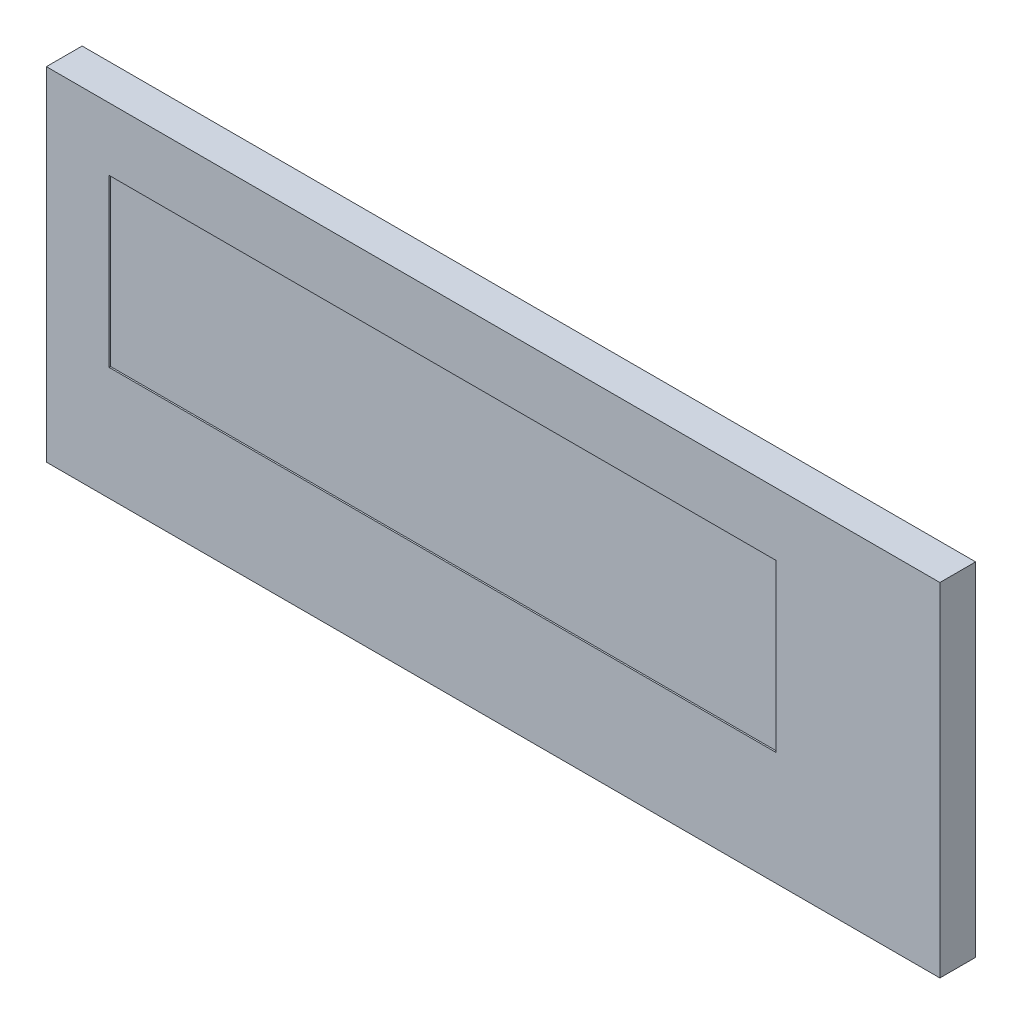
ISO-10303-21;
HEADER;
FILE_DESCRIPTION(('STEP AP214'),'2;1');
FILE_NAME('part.step','',(''),(''),'','','');
FILE_SCHEMA(('AUTOMOTIVE_DESIGN { 1 0 10303 214 1 1 1 1 }'));
ENDSEC;
DATA;
#1=APPLICATION_CONTEXT('core data for automotive mechanical design processes');
#2=APPLICATION_PROTOCOL_DEFINITION('international standard','automotive_design',2000,#1);
#3=PRODUCT_CONTEXT('',#1,'mechanical');
#4=PRODUCT('Part','Part','',(#3));
#5=PRODUCT_RELATED_PRODUCT_CATEGORY('part','',(#4));
#6=PRODUCT_DEFINITION_FORMATION('','',#4);
#7=PRODUCT_DEFINITION_CONTEXT('part definition',#1,'design');
#8=PRODUCT_DEFINITION('design','',#6,#7);
#9=PRODUCT_DEFINITION_SHAPE('','',#8);
#10=(LENGTH_UNIT() NAMED_UNIT(*) SI_UNIT(.MILLI.,.METRE.));
#11=(NAMED_UNIT(*) PLANE_ANGLE_UNIT() SI_UNIT($,.RADIAN.));
#12=(NAMED_UNIT(*) SI_UNIT($,.STERADIAN.) SOLID_ANGLE_UNIT());
#13=UNCERTAINTY_MEASURE_WITH_UNIT(LENGTH_MEASURE(1.E-05),#10,'distance_accuracy_value','');
#14=(GEOMETRIC_REPRESENTATION_CONTEXT(3) GLOBAL_UNCERTAINTY_ASSIGNED_CONTEXT((#13)) GLOBAL_UNIT_ASSIGNED_CONTEXT((#10,
#11,#12)) REPRESENTATION_CONTEXT('',''));
#15=CARTESIAN_POINT('',(0.,0.,0.));
#16=DIRECTION('',(0.,0.,1.));
#17=DIRECTION('',(1.,0.,0.));
#18=AXIS2_PLACEMENT_3D('',#15,#16,#17);
#19=CARTESIAN_POINT('',(0.,2.792,1.2));
#20=DIRECTION('',(0.,1.,0.));
#21=DIRECTION('',(0.,0.,1.));
#22=AXIS2_PLACEMENT_3D('',#19,#20,#21);
#23=PLANE('',#22);
#24=DIRECTION('',(0.,0.,-1.));
#25=VECTOR('',#24,1.);
#26=CARTESIAN_POINT('',(-11.192,2.792,1.2));
#27=LINE('',#26,#25);
#28=CARTESIAN_POINT('',(-11.192,2.792,1.2));
#29=VERTEX_POINT('',#28);
#30=CARTESIAN_POINT('',(-11.192,2.792,1.15));
#31=VERTEX_POINT('',#30);
#32=EDGE_CURVE('E119',#29,#31,#27,.T.);
#33=ORIENTED_EDGE('',*,*,#32,.T.);
#34=DIRECTION('',(1.,0.,0.));
#35=VECTOR('',#34,1.);
#36=CARTESIAN_POINT('',(0.,2.792,1.15));
#37=LINE('',#36,#35);
#38=CARTESIAN_POINT('',(11.192,2.792,1.15));
#39=VERTEX_POINT('',#38);
#40=EDGE_CURVE('E57',#31,#39,#37,.T.);
#41=ORIENTED_EDGE('',*,*,#40,.T.);
#42=DIRECTION('',(0.,0.,-1.));
#43=VECTOR('',#42,1.);
#44=CARTESIAN_POINT('',(11.192,2.792,1.2));
#45=LINE('',#44,#43);
#46=CARTESIAN_POINT('',(11.192,2.792,1.2));
#47=VERTEX_POINT('',#46);
#48=EDGE_CURVE('E11',#47,#39,#45,.T.);
#49=ORIENTED_EDGE('',*,*,#48,.F.);
#50=DIRECTION('',(1.,0.,0.));
#51=VECTOR('',#50,1.);
#52=CARTESIAN_POINT('',(0.,2.792,1.2));
#53=LINE('',#52,#51);
#54=EDGE_CURVE('E150',#29,#47,#53,.T.);
#55=ORIENTED_EDGE('',*,*,#54,.F.);
#56=EDGE_LOOP('',(#33,#41,#49,#55));
#57=FACE_BOUND('',#56,.T.);
#58=ADVANCED_FACE('F39',(#57),#23,.F.);
#59=CARTESIAN_POINT('',(11.192,0.,1.2));
#60=DIRECTION('',(1.,0.,0.));
#61=DIRECTION('',(0.,0.,-1.));
#62=AXIS2_PLACEMENT_3D('',#59,#60,#61);
#63=PLANE('',#62);
#64=ORIENTED_EDGE('',*,*,#48,.T.);
#65=DIRECTION('',(0.,-1.,0.));
#66=VECTOR('',#65,1.);
#67=CARTESIAN_POINT('',(11.192,0.,1.15));
#68=LINE('',#67,#66);
#69=CARTESIAN_POINT('',(11.192,-2.792,1.15));
#70=VERTEX_POINT('',#69);
#71=EDGE_CURVE('E63',#39,#70,#68,.T.);
#72=ORIENTED_EDGE('',*,*,#71,.T.);
#73=DIRECTION('',(0.,0.,-1.));
#74=VECTOR('',#73,1.);
#75=CARTESIAN_POINT('',(11.192,-2.792,1.2));
#76=LINE('',#75,#74);
#77=CARTESIAN_POINT('',(11.192,-2.792,1.2));
#78=VERTEX_POINT('',#77);
#79=EDGE_CURVE('E49',#78,#70,#76,.T.);
#80=ORIENTED_EDGE('',*,*,#79,.F.);
#81=DIRECTION('',(0.,-1.,0.));
#82=VECTOR('',#81,1.);
#83=CARTESIAN_POINT('',(11.192,0.,1.2));
#84=LINE('',#83,#82);
#85=EDGE_CURVE('E154',#47,#78,#84,.T.);
#86=ORIENTED_EDGE('',*,*,#85,.F.);
#87=EDGE_LOOP('',(#64,#72,#80,#86));
#88=FACE_BOUND('',#87,.T.);
#89=ADVANCED_FACE('F213',(#88),#63,.F.);
#90=CARTESIAN_POINT('',(0.,-2.792,1.2));
#91=DIRECTION('',(0.,1.,0.));
#92=DIRECTION('',(0.,0.,1.));
#93=AXIS2_PLACEMENT_3D('',#90,#91,#92);
#94=PLANE('',#93);
#95=DIRECTION('',(1.,0.,0.));
#96=VECTOR('',#95,1.);
#97=CARTESIAN_POINT('',(0.,-2.792,1.15));
#98=LINE('',#97,#96);
#99=CARTESIAN_POINT('',(-11.192,-2.792,1.15));
#100=VERTEX_POINT('',#99);
#101=EDGE_CURVE('E122',#100,#70,#98,.T.);
#102=ORIENTED_EDGE('',*,*,#101,.F.);
#103=DIRECTION('',(0.,0.,-1.));
#104=VECTOR('',#103,1.);
#105=CARTESIAN_POINT('',(-11.192,-2.792,1.2));
#106=LINE('',#105,#104);
#107=CARTESIAN_POINT('',(-11.192,-2.792,1.2));
#108=VERTEX_POINT('',#107);
#109=EDGE_CURVE('E108',#108,#100,#106,.T.);
#110=ORIENTED_EDGE('',*,*,#109,.F.);
#111=DIRECTION('',(1.,0.,0.));
#112=VECTOR('',#111,1.);
#113=CARTESIAN_POINT('',(0.,-2.792,1.2));
#114=LINE('',#113,#112);
#115=EDGE_CURVE('E157',#108,#78,#114,.T.);
#116=ORIENTED_EDGE('',*,*,#115,.T.);
#117=ORIENTED_EDGE('',*,*,#79,.T.);
#118=EDGE_LOOP('',(#102,#110,#116,#117));
#119=FACE_BOUND('',#118,.T.);
#120=ADVANCED_FACE('F123',(#119),#94,.T.);
#121=CARTESIAN_POINT('',(16.7,0.,1.2));
#122=DIRECTION('',(1.,0.,0.));
#123=DIRECTION('',(0.,0.,-1.));
#124=AXIS2_PLACEMENT_3D('',#121,#122,#123);
#125=PLANE('',#124);
#126=DIRECTION('',(0.,-1.,0.));
#127=VECTOR('',#126,1.);
#128=CARTESIAN_POINT('',(16.7,0.,0.));
#129=LINE('',#128,#127);
#130=CARTESIAN_POINT('',(16.7,4.9,0.));
#131=VERTEX_POINT('',#130);
#132=CARTESIAN_POINT('',(16.7,-6.6,0.));
#133=VERTEX_POINT('',#132);
#134=EDGE_CURVE('E126',#131,#133,#129,.T.);
#135=ORIENTED_EDGE('',*,*,#134,.F.);
#136=DIRECTION('',(0.,0.,-1.));
#137=VECTOR('',#136,1.);
#138=CARTESIAN_POINT('',(16.7,4.9,1.2));
#139=LINE('',#138,#137);
#140=CARTESIAN_POINT('',(16.7,4.9,1.2));
#141=VERTEX_POINT('',#140);
#142=EDGE_CURVE('E43',#141,#131,#139,.T.);
#143=ORIENTED_EDGE('',*,*,#142,.F.);
#144=DIRECTION('',(0.,-1.,0.));
#145=VECTOR('',#144,1.);
#146=CARTESIAN_POINT('',(16.7,0.,1.2));
#147=LINE('',#146,#145);
#148=CARTESIAN_POINT('',(16.7,-6.6,1.2));
#149=VERTEX_POINT('',#148);
#150=EDGE_CURVE('E135',#141,#149,#147,.T.);
#151=ORIENTED_EDGE('',*,*,#150,.T.);
#152=DIRECTION('',(0.,0.,-1.));
#153=VECTOR('',#152,1.);
#154=CARTESIAN_POINT('',(16.7,-6.6,1.2));
#155=LINE('',#154,#153);
#156=EDGE_CURVE('E162',#149,#133,#155,.T.);
#157=ORIENTED_EDGE('',*,*,#156,.T.);
#158=EDGE_LOOP('',(#135,#143,#151,#157));
#159=FACE_BOUND('',#158,.T.);
#160=ADVANCED_FACE('F41',(#159),#125,.T.);
#161=CARTESIAN_POINT('',(0.,4.9,1.2));
#162=DIRECTION('',(0.,1.,0.));
#163=DIRECTION('',(0.,0.,1.));
#164=AXIS2_PLACEMENT_3D('',#161,#162,#163);
#165=PLANE('',#164);
#166=DIRECTION('',(1.,0.,0.));
#167=VECTOR('',#166,1.);
#168=CARTESIAN_POINT('',(0.,4.9,0.));
#169=LINE('',#168,#167);
#170=CARTESIAN_POINT('',(-13.3,4.9,0.));
#171=VERTEX_POINT('',#170);
#172=EDGE_CURVE('E166',#171,#131,#169,.T.);
#173=ORIENTED_EDGE('',*,*,#172,.F.);
#174=DIRECTION('',(0.,0.,-1.));
#175=VECTOR('',#174,1.);
#176=CARTESIAN_POINT('',(-13.3,4.9,1.2));
#177=LINE('',#176,#175);
#178=CARTESIAN_POINT('',(-13.3,4.9,1.2));
#179=VERTEX_POINT('',#178);
#180=EDGE_CURVE('E185',#179,#171,#177,.T.);
#181=ORIENTED_EDGE('',*,*,#180,.F.);
#182=DIRECTION('',(1.,0.,0.));
#183=VECTOR('',#182,1.);
#184=CARTESIAN_POINT('',(0.,4.9,1.2));
#185=LINE('',#184,#183);
#186=EDGE_CURVE('E139',#179,#141,#185,.T.);
#187=ORIENTED_EDGE('',*,*,#186,.T.);
#188=ORIENTED_EDGE('',*,*,#142,.T.);
#189=EDGE_LOOP('',(#173,#181,#187,#188));
#190=FACE_BOUND('',#189,.T.);
#191=ADVANCED_FACE('F194',(#190),#165,.T.);
#192=CARTESIAN_POINT('',(-13.3,0.,1.2));
#193=DIRECTION('',(1.,0.,0.));
#194=DIRECTION('',(0.,1.,0.));
#195=AXIS2_PLACEMENT_3D('',#192,#193,#194);
#196=PLANE('',#195);
#197=DIRECTION('',(0.,-1.,0.));
#198=VECTOR('',#197,1.);
#199=CARTESIAN_POINT('',(-13.3,0.,0.));
#200=LINE('',#199,#198);
#201=CARTESIAN_POINT('',(-13.3,-6.6,0.));
#202=VERTEX_POINT('',#201);
#203=EDGE_CURVE('E170',#171,#202,#200,.T.);
#204=ORIENTED_EDGE('',*,*,#203,.T.);
#205=DIRECTION('',(0.,0.,-1.));
#206=VECTOR('',#205,1.);
#207=CARTESIAN_POINT('',(-13.3,-6.6,1.2));
#208=LINE('',#207,#206);
#209=CARTESIAN_POINT('',(-13.3,-6.6,1.2));
#210=VERTEX_POINT('',#209);
#211=EDGE_CURVE('E182',#210,#202,#208,.T.);
#212=ORIENTED_EDGE('',*,*,#211,.F.);
#213=DIRECTION('',(0.,-1.,0.));
#214=VECTOR('',#213,1.);
#215=CARTESIAN_POINT('',(-13.3,0.,1.2));
#216=LINE('',#215,#214);
#217=EDGE_CURVE('E144',#179,#210,#216,.T.);
#218=ORIENTED_EDGE('',*,*,#217,.F.);
#219=ORIENTED_EDGE('',*,*,#180,.T.);
#220=EDGE_LOOP('',(#204,#212,#218,#219));
#221=FACE_BOUND('',#220,.T.);
#222=ADVANCED_FACE('F203',(#221),#196,.F.);
#223=CARTESIAN_POINT('',(0.,-6.6,1.2));
#224=DIRECTION('',(0.,1.,0.));
#225=DIRECTION('',(0.,0.,1.));
#226=AXIS2_PLACEMENT_3D('',#223,#224,#225);
#227=PLANE('',#226);
#228=DIRECTION('',(1.,0.,0.));
#229=VECTOR('',#228,1.);
#230=CARTESIAN_POINT('',(0.,-6.6,0.));
#231=LINE('',#230,#229);
#232=EDGE_CURVE('E140',#202,#133,#231,.T.);
#233=ORIENTED_EDGE('',*,*,#232,.T.);
#234=ORIENTED_EDGE('',*,*,#156,.F.);
#235=DIRECTION('',(1.,0.,0.));
#236=VECTOR('',#235,1.);
#237=CARTESIAN_POINT('',(0.,-6.6,1.2));
#238=LINE('',#237,#236);
#239=EDGE_CURVE('E147',#210,#149,#238,.T.);
#240=ORIENTED_EDGE('',*,*,#239,.F.);
#241=ORIENTED_EDGE('',*,*,#211,.T.);
#242=EDGE_LOOP('',(#233,#234,#240,#241));
#243=FACE_BOUND('',#242,.T.);
#244=ADVANCED_FACE('F206',(#243),#227,.F.);
#245=CARTESIAN_POINT('',(-11.192,0.,1.2));
#246=DIRECTION('',(1.,0.,0.));
#247=DIRECTION('',(0.,0.,-1.));
#248=AXIS2_PLACEMENT_3D('',#245,#246,#247);
#249=PLANE('',#248);
#250=DIRECTION('',(0.,-1.,0.));
#251=VECTOR('',#250,1.);
#252=CARTESIAN_POINT('',(-11.192,0.,1.15));
#253=LINE('',#252,#251);
#254=EDGE_CURVE('E112',#31,#100,#253,.T.);
#255=ORIENTED_EDGE('',*,*,#254,.F.);
#256=ORIENTED_EDGE('',*,*,#32,.F.);
#257=DIRECTION('',(0.,-1.,0.));
#258=VECTOR('',#257,1.);
#259=CARTESIAN_POINT('',(-11.192,0.,1.2));
#260=LINE('',#259,#258);
#261=EDGE_CURVE('E114',#29,#108,#260,.T.);
#262=ORIENTED_EDGE('',*,*,#261,.T.);
#263=ORIENTED_EDGE('',*,*,#109,.T.);
#264=EDGE_LOOP('',(#255,#256,#262,#263));
#265=FACE_BOUND('',#264,.T.);
#266=ADVANCED_FACE('F110',(#265),#249,.T.);
#267=CARTESIAN_POINT('',(0.,0.,1.2));
#268=DIRECTION('',(0.,0.,1.));
#269=DIRECTION('',(1.,0.,0.));
#270=AXIS2_PLACEMENT_3D('',#267,#268,#269);
#271=PLANE('',#270);
#272=ORIENTED_EDGE('',*,*,#150,.F.);
#273=ORIENTED_EDGE('',*,*,#186,.F.);
#274=ORIENTED_EDGE('',*,*,#217,.T.);
#275=ORIENTED_EDGE('',*,*,#239,.T.);
#276=EDGE_LOOP('',(#272,#273,#274,#275));
#277=FACE_BOUND('',#276,.T.);
#278=ORIENTED_EDGE('',*,*,#54,.T.);
#279=ORIENTED_EDGE('',*,*,#85,.T.);
#280=ORIENTED_EDGE('',*,*,#115,.F.);
#281=ORIENTED_EDGE('',*,*,#261,.F.);
#282=EDGE_LOOP('',(#278,#279,#280,#281));
#283=FACE_BOUND('',#282,.T.);
#284=ADVANCED_FACE('F208',(#277,#283),#271,.T.);
#285=CARTESIAN_POINT('',(0.,0.,0.));
#286=DIRECTION('',(0.,0.,1.));
#287=DIRECTION('',(1.,0.,0.));
#288=AXIS2_PLACEMENT_3D('',#285,#286,#287);
#289=PLANE('',#288);
#290=ORIENTED_EDGE('',*,*,#134,.T.);
#291=ORIENTED_EDGE('',*,*,#232,.F.);
#292=ORIENTED_EDGE('',*,*,#203,.F.);
#293=ORIENTED_EDGE('',*,*,#172,.T.);
#294=EDGE_LOOP('',(#290,#291,#292,#293));
#295=FACE_BOUND('',#294,.T.);
#296=ADVANCED_FACE('F201',(#295),#289,.F.);
#297=CARTESIAN_POINT('',(0.,0.,1.15));
#298=DIRECTION('',(0.,0.,1.));
#299=DIRECTION('',(1.,0.,0.));
#300=AXIS2_PLACEMENT_3D('',#297,#298,#299);
#301=PLANE('',#300);
#302=ORIENTED_EDGE('',*,*,#71,.F.);
#303=ORIENTED_EDGE('',*,*,#40,.F.);
#304=ORIENTED_EDGE('',*,*,#254,.T.);
#305=ORIENTED_EDGE('',*,*,#101,.T.);
#306=EDGE_LOOP('',(#302,#303,#304,#305));
#307=FACE_BOUND('',#306,.T.);
#308=ADVANCED_FACE('F128',(#307),#301,.T.);
#309=CLOSED_SHELL('',(#58,#89,#120,#160,#191,#222,#244,#266,#284,#296,#308));
#310=MANIFOLD_SOLID_BREP('B2',#309);
#311=ADVANCED_BREP_SHAPE_REPRESENTATION('',(#18,#310),#14);
#312=SHAPE_DEFINITION_REPRESENTATION(#9,#311);
ENDSEC;
END-ISO-10303-21;
